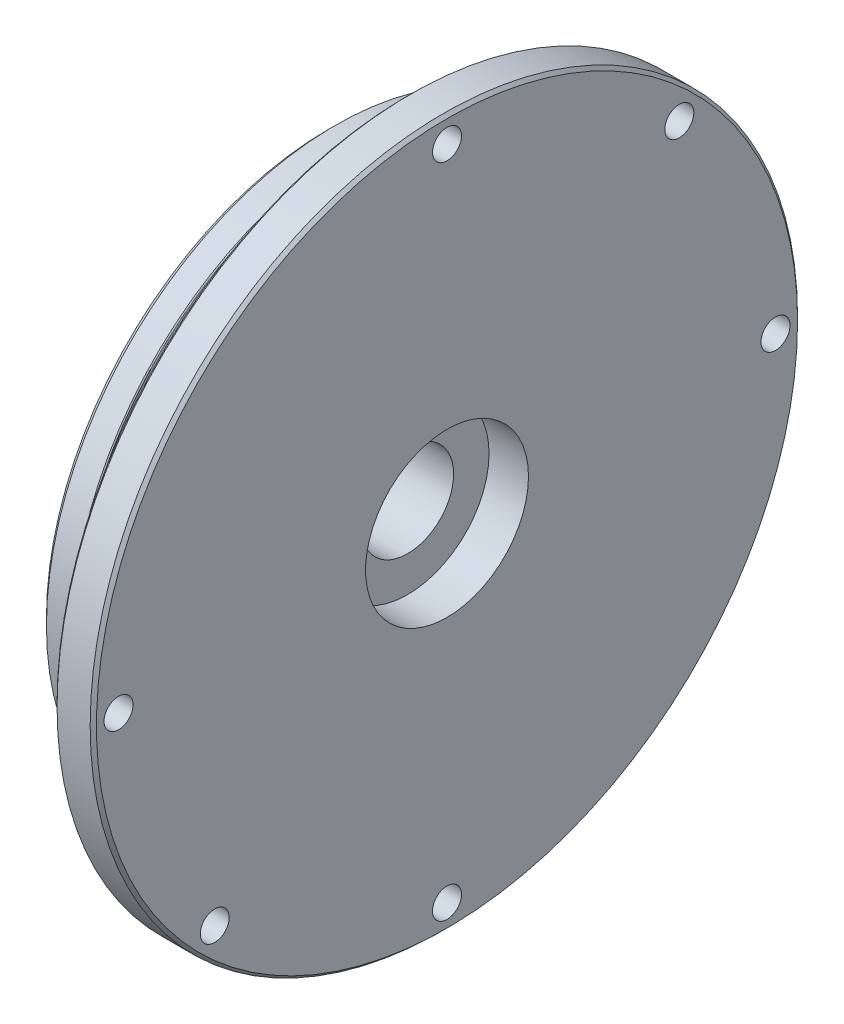
ISO-10303-21;
HEADER;
FILE_DESCRIPTION(('STEP AP214'),'2;1');
FILE_NAME('part.step','',(''),(''),'','','');
FILE_SCHEMA(('AUTOMOTIVE_DESIGN { 1 0 10303 214 1 1 1 1 }'));
ENDSEC;
DATA;
#1=APPLICATION_CONTEXT('core data for automotive mechanical design processes');
#2=APPLICATION_PROTOCOL_DEFINITION('international standard','automotive_design',2000,#1);
#3=PRODUCT_CONTEXT('',#1,'mechanical');
#4=PRODUCT('Part','Part','',(#3));
#5=PRODUCT_RELATED_PRODUCT_CATEGORY('part','',(#4));
#6=PRODUCT_DEFINITION_FORMATION('','',#4);
#7=PRODUCT_DEFINITION_CONTEXT('part definition',#1,'design');
#8=PRODUCT_DEFINITION('design','',#6,#7);
#9=PRODUCT_DEFINITION_SHAPE('','',#8);
#10=(LENGTH_UNIT() NAMED_UNIT(*) SI_UNIT(.MILLI.,.METRE.));
#11=(NAMED_UNIT(*) PLANE_ANGLE_UNIT() SI_UNIT($,.RADIAN.));
#12=(NAMED_UNIT(*) SI_UNIT($,.STERADIAN.) SOLID_ANGLE_UNIT());
#13=UNCERTAINTY_MEASURE_WITH_UNIT(LENGTH_MEASURE(1.E-05),#10,'distance_accuracy_value','');
#14=(GEOMETRIC_REPRESENTATION_CONTEXT(3) GLOBAL_UNCERTAINTY_ASSIGNED_CONTEXT((#13)) GLOBAL_UNIT_ASSIGNED_CONTEXT((#10,
#11,#12)) REPRESENTATION_CONTEXT('',''));
#15=CARTESIAN_POINT('',(0.,0.,0.));
#16=DIRECTION('',(0.,0.,1.));
#17=DIRECTION('',(1.,0.,0.));
#18=AXIS2_PLACEMENT_3D('',#15,#16,#17);
#19=CARTESIAN_POINT('',(14.2875,0.,0.));
#20=DIRECTION('',(-1.,0.,0.));
#21=DIRECTION('',(0.,0.,1.));
#22=AXIS2_PLACEMENT_3D('',#19,#20,#21);
#23=CYLINDRICAL_SURFACE('',#22,42.7355);
#24=CARTESIAN_POINT('',(13.9065,0.,0.));
#25=DIRECTION('',(1.,0.,0.));
#26=DIRECTION('',(0.,0.,-1.));
#27=AXIS2_PLACEMENT_3D('',#24,#25,#26);
#28=CIRCLE('',#27,42.7355);
#29=CARTESIAN_POINT('',(13.9065,0.,-42.7355));
#30=VERTEX_POINT('',#29);
#31=EDGE_CURVE('E90',#30,#30,#28,.F.);
#32=ORIENTED_EDGE('',*,*,#31,.T.);
#33=EDGE_LOOP('',(#32));
#34=FACE_BOUND('',#33,.T.);
#35=CARTESIAN_POINT('',(9.90599999999998,0.,0.));
#36=DIRECTION('',(-1.,0.,0.));
#37=DIRECTION('',(0.,0.,1.));
#38=AXIS2_PLACEMENT_3D('',#35,#36,#37);
#39=CIRCLE('',#38,42.7355);
#40=CARTESIAN_POINT('',(9.90599999999998,0.,42.7355));
#41=VERTEX_POINT('',#40);
#42=EDGE_CURVE('E94',#41,#41,#39,.F.);
#43=ORIENTED_EDGE('',*,*,#42,.T.);
#44=EDGE_LOOP('',(#43));
#45=FACE_BOUND('',#44,.T.);
#46=ADVANCED_FACE('F34',(#34,#45),#23,.T.);
#47=CARTESIAN_POINT('',(14.2875,42.7355,0.));
#48=DIRECTION('',(1.,0.,0.));
#49=DIRECTION('',(0.,0.,-1.));
#50=AXIS2_PLACEMENT_3D('',#47,#48,#49);
#51=PLANE('',#50);
#52=CARTESIAN_POINT('',(14.2875,0.,0.));
#53=DIRECTION('',(1.,0.,0.));
#54=DIRECTION('',(0.,0.,-1.));
#55=AXIS2_PLACEMENT_3D('',#52,#53,#54);
#56=CIRCLE('',#55,42.3545);
#57=CARTESIAN_POINT('',(14.2875,0.,-42.3545));
#58=VERTEX_POINT('',#57);
#59=EDGE_CURVE('E86',#58,#58,#56,.T.);
#60=ORIENTED_EDGE('',*,*,#59,.T.);
#61=EDGE_LOOP('',(#60));
#62=FACE_BOUND('',#61,.T.);
#63=CARTESIAN_POINT('',(14.2875,0.,0.));
#64=DIRECTION('',(1.,0.,0.));
#65=DIRECTION('',(0.,0.,-1.));
#66=AXIS2_PLACEMENT_3D('',#63,#64,#65);
#67=CIRCLE('',#66,9.8425);
#68=CARTESIAN_POINT('',(14.2875,0.,-9.8425));
#69=VERTEX_POINT('',#68);
#70=EDGE_CURVE('E158',#69,#69,#67,.T.);
#71=ORIENTED_EDGE('',*,*,#70,.F.);
#72=EDGE_LOOP('',(#71));
#73=FACE_BOUND('',#72,.T.);
#74=CARTESIAN_POINT('',(14.2875,-28.0633003783411,28.0633003783412));
#75=DIRECTION('',(-1.,0.,0.));
#76=DIRECTION('',(0.,0.,1.));
#77=AXIS2_PLACEMENT_3D('',#74,#75,#76);
#78=CIRCLE('',#77,1.75259999999999);
#79=CARTESIAN_POINT('',(14.2875,-28.0633003783411,29.8159003783411));
#80=VERTEX_POINT('',#79);
#81=EDGE_CURVE('E140',#80,#80,#78,.T.);
#82=ORIENTED_EDGE('',*,*,#81,.T.);
#83=EDGE_LOOP('',(#82));
#84=FACE_BOUND('',#83,.T.);
#85=CARTESIAN_POINT('',(14.2875,28.0633003783411,-28.0633003783411));
#86=DIRECTION('',(-1.,0.,0.));
#87=DIRECTION('',(0.,0.,1.));
#88=AXIS2_PLACEMENT_3D('',#85,#86,#87);
#89=CIRCLE('',#88,1.75259999999999);
#90=CARTESIAN_POINT('',(14.2875,28.0633003783411,-26.3107003783412));
#91=VERTEX_POINT('',#90);
#92=EDGE_CURVE('E134',#91,#91,#89,.T.);
#93=ORIENTED_EDGE('',*,*,#92,.T.);
#94=EDGE_LOOP('',(#93));
#95=FACE_BOUND('',#94,.T.);
#96=CARTESIAN_POINT('',(14.2875,0.,39.6875));
#97=DIRECTION('',(-1.,0.,0.));
#98=DIRECTION('',(0.,0.,1.));
#99=AXIS2_PLACEMENT_3D('',#96,#97,#98);
#100=CIRCLE('',#99,1.75259999999999);
#101=CARTESIAN_POINT('',(14.2875,0.,41.4401));
#102=VERTEX_POINT('',#101);
#103=EDGE_CURVE('E126',#102,#102,#100,.T.);
#104=ORIENTED_EDGE('',*,*,#103,.T.);
#105=EDGE_LOOP('',(#104));
#106=FACE_BOUND('',#105,.T.);
#107=CARTESIAN_POINT('',(14.2875,0.,-39.6875));
#108=DIRECTION('',(-1.,0.,0.));
#109=DIRECTION('',(0.,0.,1.));
#110=AXIS2_PLACEMENT_3D('',#107,#108,#109);
#111=CIRCLE('',#110,1.75259999999999);
#112=CARTESIAN_POINT('',(14.2875,0.,-37.9349));
#113=VERTEX_POINT('',#112);
#114=EDGE_CURVE('E118',#113,#113,#111,.T.);
#115=ORIENTED_EDGE('',*,*,#114,.T.);
#116=EDGE_LOOP('',(#115));
#117=FACE_BOUND('',#116,.T.);
#118=CARTESIAN_POINT('',(14.2875,-39.6875,0.));
#119=DIRECTION('',(-1.,0.,0.));
#120=DIRECTION('',(0.,0.,1.));
#121=AXIS2_PLACEMENT_3D('',#118,#119,#120);
#122=CIRCLE('',#121,1.75259999999999);
#123=CARTESIAN_POINT('',(14.2875,-39.6875,1.75259999999999));
#124=VERTEX_POINT('',#123);
#125=EDGE_CURVE('E110',#124,#124,#122,.T.);
#126=ORIENTED_EDGE('',*,*,#125,.T.);
#127=EDGE_LOOP('',(#126));
#128=FACE_BOUND('',#127,.T.);
#129=CARTESIAN_POINT('',(14.2875,39.6875,0.));
#130=DIRECTION('',(-1.,0.,0.));
#131=DIRECTION('',(0.,0.,1.));
#132=AXIS2_PLACEMENT_3D('',#129,#130,#131);
#133=CIRCLE('',#132,1.75259999999999);
#134=CARTESIAN_POINT('',(14.2875,39.6875,1.75259999999999));
#135=VERTEX_POINT('',#134);
#136=EDGE_CURVE('E102',#135,#135,#133,.T.);
#137=ORIENTED_EDGE('',*,*,#136,.T.);
#138=EDGE_LOOP('',(#137));
#139=FACE_BOUND('',#138,.T.);
#140=ADVANCED_FACE('F164',(#62,#73,#84,#95,#106,#117,#128,#139),#51,.T.);
#141=CARTESIAN_POINT('',(0.,0.,0.));
#142=DIRECTION('',(-1.,0.,0.));
#143=DIRECTION('',(0.,0.,1.));
#144=AXIS2_PLACEMENT_3D('',#141,#142,#143);
#145=PLANE('',#144);
#146=CARTESIAN_POINT('',(0.,0.,0.));
#147=DIRECTION('',(-1.,0.,0.));
#148=DIRECTION('',(0.,0.,1.));
#149=AXIS2_PLACEMENT_3D('',#146,#147,#148);
#150=CIRCLE('',#149,34.1122);
#151=CARTESIAN_POINT('',(0.,0.,34.1122));
#152=VERTEX_POINT('',#151);
#153=EDGE_CURVE('E78',#152,#152,#150,.T.);
#154=ORIENTED_EDGE('',*,*,#153,.T.);
#155=EDGE_LOOP('',(#154));
#156=FACE_BOUND('',#155,.T.);
#157=CARTESIAN_POINT('',(0.,0.,0.));
#158=DIRECTION('',(1.,0.,0.));
#159=DIRECTION('',(0.,0.,-1.));
#160=AXIS2_PLACEMENT_3D('',#157,#158,#159);
#161=CIRCLE('',#160,5.55625);
#162=CARTESIAN_POINT('',(0.,0.,-5.55625));
#163=VERTEX_POINT('',#162);
#164=EDGE_CURVE('E148',#163,#163,#161,.T.);
#165=ORIENTED_EDGE('',*,*,#164,.T.);
#166=EDGE_LOOP('',(#165));
#167=FACE_BOUND('',#166,.T.);
#168=ADVANCED_FACE('F167',(#156,#167),#145,.T.);
#169=CARTESIAN_POINT('',(14.2875,0.,0.));
#170=DIRECTION('',(-1.,0.,0.));
#171=DIRECTION('',(0.,0.,1.));
#172=AXIS2_PLACEMENT_3D('',#169,#170,#171);
#173=CYLINDRICAL_SURFACE('',#172,34.8996);
#174=CARTESIAN_POINT('',(3.81,0.,0.));
#175=DIRECTION('',(1.,0.,0.));
#176=DIRECTION('',(0.,0.,-1.));
#177=AXIS2_PLACEMENT_3D('',#174,#175,#176);
#178=CIRCLE('',#177,34.8996);
#179=CARTESIAN_POINT('',(3.81,0.,-34.8996));
#180=VERTEX_POINT('',#179);
#181=EDGE_CURVE('E65',#180,#180,#178,.F.);
#182=ORIENTED_EDGE('',*,*,#181,.T.);
#183=EDGE_LOOP('',(#182));
#184=FACE_BOUND('',#183,.T.);
#185=CARTESIAN_POINT('',(0.78740000000003,0.,0.));
#186=DIRECTION('',(-1.,0.,0.));
#187=DIRECTION('',(0.,0.,1.));
#188=AXIS2_PLACEMENT_3D('',#185,#186,#187);
#189=CIRCLE('',#188,34.8996);
#190=CARTESIAN_POINT('',(0.78740000000003,0.,34.8996));
#191=VERTEX_POINT('',#190);
#192=EDGE_CURVE('E75',#191,#191,#189,.F.);
#193=ORIENTED_EDGE('',*,*,#192,.T.);
#194=EDGE_LOOP('',(#193));
#195=FACE_BOUND('',#194,.T.);
#196=ADVANCED_FACE('F252',(#184,#195),#173,.T.);
#197=CARTESIAN_POINT('',(3.937,34.8996,0.));
#198=DIRECTION('',(1.,0.,0.));
#199=DIRECTION('',(0.,0.,-1.));
#200=AXIS2_PLACEMENT_3D('',#197,#198,#199);
#201=PLANE('',#200);
#202=CARTESIAN_POINT('',(3.937,0.,0.));
#203=DIRECTION('',(1.,0.,0.));
#204=DIRECTION('',(0.,0.,-1.));
#205=AXIS2_PLACEMENT_3D('',#202,#203,#204);
#206=CIRCLE('',#205,34.036);
#207=CARTESIAN_POINT('',(3.937,0.,-34.036));
#208=VERTEX_POINT('',#207);
#209=EDGE_CURVE('E10',#208,#208,#206,.F.);
#210=ORIENTED_EDGE('',*,*,#209,.T.);
#211=EDGE_LOOP('',(#210));
#212=FACE_BOUND('',#211,.T.);
#213=CARTESIAN_POINT('',(3.937,0.,0.));
#214=DIRECTION('',(1.,0.,0.));
#215=DIRECTION('',(0.,0.,-1.));
#216=AXIS2_PLACEMENT_3D('',#213,#214,#215);
#217=CIRCLE('',#216,34.7726);
#218=CARTESIAN_POINT('',(3.937,0.,-34.7726));
#219=VERTEX_POINT('',#218);
#220=EDGE_CURVE('E61',#219,#219,#217,.T.);
#221=ORIENTED_EDGE('',*,*,#220,.T.);
#222=EDGE_LOOP('',(#221));
#223=FACE_BOUND('',#222,.T.);
#224=ADVANCED_FACE('F245',(#212,#223),#201,.T.);
#225=CARTESIAN_POINT('',(14.2875,0.,0.));
#226=DIRECTION('',(-1.,0.,0.));
#227=DIRECTION('',(0.,0.,1.));
#228=AXIS2_PLACEMENT_3D('',#225,#226,#227);
#229=CYLINDRICAL_SURFACE('',#228,33.655);
#230=CARTESIAN_POINT('',(5.96899999999999,0.,0.));
#231=DIRECTION('',(-1.,0.,0.));
#232=DIRECTION('',(0.,0.,1.));
#233=AXIS2_PLACEMENT_3D('',#230,#231,#232);
#234=CIRCLE('',#233,33.655);
#235=CARTESIAN_POINT('',(5.96899999999999,0.,33.655));
#236=VERTEX_POINT('',#235);
#237=EDGE_CURVE('E49',#236,#236,#234,.T.);
#238=ORIENTED_EDGE('',*,*,#237,.T.);
#239=EDGE_LOOP('',(#238));
#240=FACE_BOUND('',#239,.T.);
#241=CARTESIAN_POINT('',(4.318,0.,0.));
#242=DIRECTION('',(1.,0.,0.));
#243=DIRECTION('',(0.,0.,-1.));
#244=AXIS2_PLACEMENT_3D('',#241,#242,#243);
#245=CIRCLE('',#244,33.655);
#246=CARTESIAN_POINT('',(4.318,0.,-33.655));
#247=VERTEX_POINT('',#246);
#248=EDGE_CURVE('E55',#247,#247,#245,.T.);
#249=ORIENTED_EDGE('',*,*,#248,.T.);
#250=EDGE_LOOP('',(#249));
#251=FACE_BOUND('',#250,.T.);
#252=ADVANCED_FACE('F204',(#240,#251),#229,.T.);
#253=CARTESIAN_POINT('',(6.35,33.655,0.));
#254=DIRECTION('',(-1.,0.,0.));
#255=DIRECTION('',(0.,0.,1.));
#256=AXIS2_PLACEMENT_3D('',#253,#254,#255);
#257=PLANE('',#256);
#258=CARTESIAN_POINT('',(6.35,0.,0.));
#259=DIRECTION('',(-1.,0.,0.));
#260=DIRECTION('',(0.,0.,1.));
#261=AXIS2_PLACEMENT_3D('',#258,#259,#260);
#262=CIRCLE('',#261,34.036);
#263=CARTESIAN_POINT('',(6.35,0.,34.036));
#264=VERTEX_POINT('',#263);
#265=EDGE_CURVE('E42',#264,#264,#262,.F.);
#266=ORIENTED_EDGE('',*,*,#265,.T.);
#267=EDGE_LOOP('',(#266));
#268=FACE_BOUND('',#267,.T.);
#269=CARTESIAN_POINT('',(6.35,0.,0.));
#270=DIRECTION('',(-1.,0.,0.));
#271=DIRECTION('',(0.,0.,1.));
#272=AXIS2_PLACEMENT_3D('',#269,#270,#271);
#273=CIRCLE('',#272,34.7726);
#274=CARTESIAN_POINT('',(6.35,0.,34.7726));
#275=VERTEX_POINT('',#274);
#276=EDGE_CURVE('E72',#275,#275,#273,.T.);
#277=ORIENTED_EDGE('',*,*,#276,.T.);
#278=EDGE_LOOP('',(#277));
#279=FACE_BOUND('',#278,.T.);
#280=ADVANCED_FACE('F198',(#268,#279),#257,.T.);
#281=CARTESIAN_POINT('',(14.2875,0.,0.));
#282=DIRECTION('',(-1.,0.,0.));
#283=DIRECTION('',(0.,0.,1.));
#284=AXIS2_PLACEMENT_3D('',#281,#282,#283);
#285=CYLINDRICAL_SURFACE('',#284,34.8996);
#286=CARTESIAN_POINT('',(6.47699999999999,0.,0.));
#287=DIRECTION('',(-1.,0.,0.));
#288=DIRECTION('',(0.,0.,1.));
#289=AXIS2_PLACEMENT_3D('',#286,#287,#288);
#290=CIRCLE('',#289,34.8996);
#291=CARTESIAN_POINT('',(6.47699999999999,0.,34.8996));
#292=VERTEX_POINT('',#291);
#293=EDGE_CURVE('E68',#292,#292,#290,.F.);
#294=ORIENTED_EDGE('',*,*,#293,.T.);
#295=EDGE_LOOP('',(#294));
#296=FACE_BOUND('',#295,.T.);
#297=CARTESIAN_POINT('',(9.525,0.,0.));
#298=DIRECTION('',(-1.,0.,0.));
#299=DIRECTION('',(0.,0.,1.));
#300=AXIS2_PLACEMENT_3D('',#297,#298,#299);
#301=CIRCLE('',#300,34.8996);
#302=CARTESIAN_POINT('',(9.525,0.,34.8996));
#303=VERTEX_POINT('',#302);
#304=EDGE_CURVE('E98',#303,#303,#301,.T.);
#305=ORIENTED_EDGE('',*,*,#304,.T.);
#306=EDGE_LOOP('',(#305));
#307=FACE_BOUND('',#306,.T.);
#308=ADVANCED_FACE('F192',(#296,#307),#285,.T.);
#309=CARTESIAN_POINT('',(9.525,34.8996,0.));
#310=DIRECTION('',(-1.,0.,0.));
#311=DIRECTION('',(0.,0.,1.));
#312=AXIS2_PLACEMENT_3D('',#309,#310,#311);
#313=PLANE('',#312);
#314=CARTESIAN_POINT('',(9.525,0.,0.));
#315=DIRECTION('',(-1.,0.,0.));
#316=DIRECTION('',(0.,0.,1.));
#317=AXIS2_PLACEMENT_3D('',#314,#315,#316);
#318=CIRCLE('',#317,42.3545);
#319=CARTESIAN_POINT('',(9.525,0.,42.3545));
#320=VERTEX_POINT('',#319);
#321=EDGE_CURVE('E82',#320,#320,#318,.T.);
#322=ORIENTED_EDGE('',*,*,#321,.T.);
#323=EDGE_LOOP('',(#322));
#324=FACE_BOUND('',#323,.T.);
#325=CARTESIAN_POINT('',(9.52499999999999,-28.0633003783411,28.0633003783412));
#326=DIRECTION('',(-1.,0.,0.));
#327=DIRECTION('',(0.,0.,1.));
#328=AXIS2_PLACEMENT_3D('',#325,#326,#327);
#329=CIRCLE('',#328,1.75259999999999);
#330=CARTESIAN_POINT('',(9.52499999999999,-28.0633003783411,29.8159003783411));
#331=VERTEX_POINT('',#330);
#332=EDGE_CURVE('E144',#331,#331,#329,.T.);
#333=ORIENTED_EDGE('',*,*,#332,.F.);
#334=EDGE_LOOP('',(#333));
#335=FACE_BOUND('',#334,.T.);
#336=CARTESIAN_POINT('',(9.52499999999999,28.0633003783411,-28.0633003783411));
#337=DIRECTION('',(-1.,0.,0.));
#338=DIRECTION('',(0.,0.,1.));
#339=AXIS2_PLACEMENT_3D('',#336,#337,#338);
#340=CIRCLE('',#339,1.75259999999999);
#341=CARTESIAN_POINT('',(9.52499999999999,28.0633003783411,-26.3107003783412));
#342=VERTEX_POINT('',#341);
#343=EDGE_CURVE('E137',#342,#342,#340,.T.);
#344=ORIENTED_EDGE('',*,*,#343,.F.);
#345=EDGE_LOOP('',(#344));
#346=FACE_BOUND('',#345,.T.);
#347=CARTESIAN_POINT('',(9.52499999999999,0.,39.6875));
#348=DIRECTION('',(-1.,0.,0.));
#349=DIRECTION('',(0.,0.,1.));
#350=AXIS2_PLACEMENT_3D('',#347,#348,#349);
#351=CIRCLE('',#350,1.75259999999999);
#352=CARTESIAN_POINT('',(9.52499999999999,0.,41.4401));
#353=VERTEX_POINT('',#352);
#354=EDGE_CURVE('E130',#353,#353,#351,.T.);
#355=ORIENTED_EDGE('',*,*,#354,.F.);
#356=EDGE_LOOP('',(#355));
#357=FACE_BOUND('',#356,.T.);
#358=CARTESIAN_POINT('',(9.52499999999999,0.,-39.6875));
#359=DIRECTION('',(-1.,0.,0.));
#360=DIRECTION('',(0.,0.,1.));
#361=AXIS2_PLACEMENT_3D('',#358,#359,#360);
#362=CIRCLE('',#361,1.75259999999999);
#363=CARTESIAN_POINT('',(9.52499999999999,0.,-37.9349));
#364=VERTEX_POINT('',#363);
#365=EDGE_CURVE('E122',#364,#364,#362,.T.);
#366=ORIENTED_EDGE('',*,*,#365,.F.);
#367=EDGE_LOOP('',(#366));
#368=FACE_BOUND('',#367,.T.);
#369=CARTESIAN_POINT('',(9.52499999999999,-39.6875,0.));
#370=DIRECTION('',(-1.,0.,0.));
#371=DIRECTION('',(0.,0.,1.));
#372=AXIS2_PLACEMENT_3D('',#369,#370,#371);
#373=CIRCLE('',#372,1.75259999999999);
#374=CARTESIAN_POINT('',(9.52499999999999,-39.6875,1.75259999999999));
#375=VERTEX_POINT('',#374);
#376=EDGE_CURVE('E114',#375,#375,#373,.T.);
#377=ORIENTED_EDGE('',*,*,#376,.F.);
#378=EDGE_LOOP('',(#377));
#379=FACE_BOUND('',#378,.T.);
#380=CARTESIAN_POINT('',(9.52499999999999,39.6875,0.));
#381=DIRECTION('',(-1.,0.,0.));
#382=DIRECTION('',(0.,0.,1.));
#383=AXIS2_PLACEMENT_3D('',#380,#381,#382);
#384=CIRCLE('',#383,1.75259999999999);
#385=CARTESIAN_POINT('',(9.52499999999999,39.6875,1.75259999999999));
#386=VERTEX_POINT('',#385);
#387=EDGE_CURVE('E106',#386,#386,#384,.T.);
#388=ORIENTED_EDGE('',*,*,#387,.F.);
#389=EDGE_LOOP('',(#388));
#390=FACE_BOUND('',#389,.T.);
#391=ORIENTED_EDGE('',*,*,#304,.F.);
#392=EDGE_LOOP('',(#391));
#393=FACE_BOUND('',#392,.T.);
#394=ADVANCED_FACE('F186',(#324,#335,#346,#357,#368,#379,#390,#393),#313,.T.);
#395=CARTESIAN_POINT('',(9.525,39.6875,0.));
#396=DIRECTION('',(-1.,0.,0.));
#397=DIRECTION('',(0.,0.,1.));
#398=AXIS2_PLACEMENT_3D('',#395,#396,#397);
#399=CYLINDRICAL_SURFACE('',#398,1.75259999999999);
#400=ORIENTED_EDGE('',*,*,#136,.F.);
#401=EDGE_LOOP('',(#400));
#402=FACE_BOUND('',#401,.T.);
#403=ORIENTED_EDGE('',*,*,#387,.T.);
#404=EDGE_LOOP('',(#403));
#405=FACE_BOUND('',#404,.T.);
#406=ADVANCED_FACE('F182',(#402,#405),#399,.F.);
#407=CARTESIAN_POINT('',(9.525,-39.6875,0.));
#408=DIRECTION('',(-1.,0.,0.));
#409=DIRECTION('',(0.,0.,1.));
#410=AXIS2_PLACEMENT_3D('',#407,#408,#409);
#411=CYLINDRICAL_SURFACE('',#410,1.75259999999999);
#412=ORIENTED_EDGE('',*,*,#125,.F.);
#413=EDGE_LOOP('',(#412));
#414=FACE_BOUND('',#413,.T.);
#415=ORIENTED_EDGE('',*,*,#376,.T.);
#416=EDGE_LOOP('',(#415));
#417=FACE_BOUND('',#416,.T.);
#418=ADVANCED_FACE('F185',(#414,#417),#411,.F.);
#419=CARTESIAN_POINT('',(9.525,0.,-39.6875));
#420=DIRECTION('',(-1.,0.,0.));
#421=DIRECTION('',(0.,0.,1.));
#422=AXIS2_PLACEMENT_3D('',#419,#420,#421);
#423=CYLINDRICAL_SURFACE('',#422,1.75259999999999);
#424=ORIENTED_EDGE('',*,*,#114,.F.);
#425=EDGE_LOOP('',(#424));
#426=FACE_BOUND('',#425,.T.);
#427=ORIENTED_EDGE('',*,*,#365,.T.);
#428=EDGE_LOOP('',(#427));
#429=FACE_BOUND('',#428,.T.);
#430=ADVANCED_FACE('F293',(#426,#429),#423,.F.);
#431=CARTESIAN_POINT('',(9.525,0.,39.6875));
#432=DIRECTION('',(-1.,0.,0.));
#433=DIRECTION('',(0.,0.,1.));
#434=AXIS2_PLACEMENT_3D('',#431,#432,#433);
#435=CYLINDRICAL_SURFACE('',#434,1.75259999999999);
#436=ORIENTED_EDGE('',*,*,#103,.F.);
#437=EDGE_LOOP('',(#436));
#438=FACE_BOUND('',#437,.T.);
#439=ORIENTED_EDGE('',*,*,#354,.T.);
#440=EDGE_LOOP('',(#439));
#441=FACE_BOUND('',#440,.T.);
#442=ADVANCED_FACE('F289',(#438,#441),#435,.F.);
#443=CARTESIAN_POINT('',(9.525,28.0633003783411,-28.0633003783411));
#444=DIRECTION('',(-1.,0.,0.));
#445=DIRECTION('',(0.,0.,1.));
#446=AXIS2_PLACEMENT_3D('',#443,#444,#445);
#447=CYLINDRICAL_SURFACE('',#446,1.75259999999999);
#448=ORIENTED_EDGE('',*,*,#92,.F.);
#449=EDGE_LOOP('',(#448));
#450=FACE_BOUND('',#449,.T.);
#451=ORIENTED_EDGE('',*,*,#343,.T.);
#452=EDGE_LOOP('',(#451));
#453=FACE_BOUND('',#452,.T.);
#454=ADVANCED_FACE('F285',(#450,#453),#447,.F.);
#455=CARTESIAN_POINT('',(9.525,-28.0633003783411,28.0633003783412));
#456=DIRECTION('',(-1.,0.,0.));
#457=DIRECTION('',(0.,0.,1.));
#458=AXIS2_PLACEMENT_3D('',#455,#456,#457);
#459=CYLINDRICAL_SURFACE('',#458,1.75259999999999);
#460=ORIENTED_EDGE('',*,*,#81,.F.);
#461=EDGE_LOOP('',(#460));
#462=FACE_BOUND('',#461,.T.);
#463=ORIENTED_EDGE('',*,*,#332,.T.);
#464=EDGE_LOOP('',(#463));
#465=FACE_BOUND('',#464,.T.);
#466=ADVANCED_FACE('F269',(#462,#465),#459,.F.);
#467=CARTESIAN_POINT('',(14.2875,0.,0.));
#468=DIRECTION('',(1.,0.,0.));
#469=DIRECTION('',(0.,0.,-1.));
#470=AXIS2_PLACEMENT_3D('',#467,#468,#469);
#471=CYLINDRICAL_SURFACE('',#470,5.55625000000001);
#472=ORIENTED_EDGE('',*,*,#164,.F.);
#473=EDGE_LOOP('',(#472));
#474=FACE_BOUND('',#473,.T.);
#475=CARTESIAN_POINT('',(9.525,0.,0.));
#476=DIRECTION('',(1.,0.,0.));
#477=DIRECTION('',(0.,0.,-1.));
#478=AXIS2_PLACEMENT_3D('',#475,#476,#477);
#479=CIRCLE('',#478,5.55625000000001);
#480=CARTESIAN_POINT('',(9.525,0.,-5.55625000000001));
#481=VERTEX_POINT('',#480);
#482=EDGE_CURVE('E152',#481,#481,#479,.T.);
#483=ORIENTED_EDGE('',*,*,#482,.T.);
#484=EDGE_LOOP('',(#483));
#485=FACE_BOUND('',#484,.T.);
#486=ADVANCED_FACE('F265',(#474,#485),#471,.F.);
#487=CARTESIAN_POINT('',(9.525,5.55625000000001,0.));
#488=DIRECTION('',(-1.,0.,0.));
#489=DIRECTION('',(0.,0.,1.));
#490=AXIS2_PLACEMENT_3D('',#487,#488,#489);
#491=PLANE('',#490);
#492=ORIENTED_EDGE('',*,*,#482,.F.);
#493=EDGE_LOOP('',(#492));
#494=FACE_BOUND('',#493,.T.);
#495=CARTESIAN_POINT('',(9.525,0.,0.));
#496=DIRECTION('',(1.,0.,0.));
#497=DIRECTION('',(0.,0.,-1.));
#498=AXIS2_PLACEMENT_3D('',#495,#496,#497);
#499=CIRCLE('',#498,9.8425);
#500=CARTESIAN_POINT('',(9.525,0.,-9.8425));
#501=VERTEX_POINT('',#500);
#502=EDGE_CURVE('E155',#501,#501,#499,.T.);
#503=ORIENTED_EDGE('',*,*,#502,.T.);
#504=EDGE_LOOP('',(#503));
#505=FACE_BOUND('',#504,.T.);
#506=ADVANCED_FACE('F268',(#494,#505),#491,.F.);
#507=CARTESIAN_POINT('',(14.2875,0.,0.));
#508=DIRECTION('',(1.,0.,0.));
#509=DIRECTION('',(0.,0.,-1.));
#510=AXIS2_PLACEMENT_3D('',#507,#508,#509);
#511=CYLINDRICAL_SURFACE('',#510,9.8425);
#512=ORIENTED_EDGE('',*,*,#502,.F.);
#513=EDGE_LOOP('',(#512));
#514=FACE_BOUND('',#513,.T.);
#515=ORIENTED_EDGE('',*,*,#70,.T.);
#516=EDGE_LOOP('',(#515));
#517=FACE_BOUND('',#516,.T.);
#518=ADVANCED_FACE('F162',(#514,#517),#511,.F.);
#519=CARTESIAN_POINT('',(13.9065,0.,0.));
#520=DIRECTION('',(-1.,0.,0.));
#521=DIRECTION('',(0.,0.,1.));
#522=AXIS2_PLACEMENT_3D('',#519,#520,#521);
#523=CONICAL_SURFACE('',#522,42.7355,0.785398163397494);
#524=ORIENTED_EDGE('',*,*,#59,.F.);
#525=EDGE_LOOP('',(#524));
#526=FACE_BOUND('',#525,.T.);
#527=ORIENTED_EDGE('',*,*,#31,.F.);
#528=EDGE_LOOP('',(#527));
#529=FACE_BOUND('',#528,.T.);
#530=ADVANCED_FACE('F214',(#526,#529),#523,.T.);
#531=CARTESIAN_POINT('',(9.525,0.,0.));
#532=DIRECTION('',(1.,0.,0.));
#533=DIRECTION('',(0.,0.,-1.));
#534=AXIS2_PLACEMENT_3D('',#531,#532,#533);
#535=CONICAL_SURFACE('',#534,42.3545,0.78539816339743);
#536=ORIENTED_EDGE('',*,*,#42,.F.);
#537=EDGE_LOOP('',(#536));
#538=FACE_BOUND('',#537,.T.);
#539=ORIENTED_EDGE('',*,*,#321,.F.);
#540=EDGE_LOOP('',(#539));
#541=FACE_BOUND('',#540,.T.);
#542=ADVANCED_FACE('F217',(#538,#541),#535,.T.);
#543=CARTESIAN_POINT('',(0.,0.,0.));
#544=DIRECTION('',(1.,0.,0.));
#545=DIRECTION('',(0.,0.,-1.));
#546=AXIS2_PLACEMENT_3D('',#543,#544,#545);
#547=CONICAL_SURFACE('',#546,34.1122,0.785398163397453);
#548=ORIENTED_EDGE('',*,*,#192,.F.);
#549=EDGE_LOOP('',(#548));
#550=FACE_BOUND('',#549,.T.);
#551=ORIENTED_EDGE('',*,*,#153,.F.);
#552=EDGE_LOOP('',(#551));
#553=FACE_BOUND('',#552,.T.);
#554=ADVANCED_FACE('F221',(#550,#553),#547,.T.);
#555=CARTESIAN_POINT('',(6.47699999999999,0.,0.));
#556=DIRECTION('',(-1.,0.,0.));
#557=DIRECTION('',(0.,0.,1.));
#558=AXIS2_PLACEMENT_3D('',#555,#556,#557);
#559=TOROIDAL_SURFACE('',#558,34.7726,0.126999999999999);
#560=ORIENTED_EDGE('',*,*,#293,.F.);
#561=EDGE_LOOP('',(#560));
#562=FACE_BOUND('',#561,.T.);
#563=ORIENTED_EDGE('',*,*,#276,.F.);
#564=EDGE_LOOP('',(#563));
#565=FACE_BOUND('',#564,.T.);
#566=ADVANCED_FACE('F225',(#562,#565),#559,.T.);
#567=CARTESIAN_POINT('',(3.81,0.,0.));
#568=DIRECTION('',(1.,0.,0.));
#569=DIRECTION('',(0.,0.,-1.));
#570=AXIS2_PLACEMENT_3D('',#567,#568,#569);
#571=TOROIDAL_SURFACE('',#570,34.7726,0.126999999999999);
#572=ORIENTED_EDGE('',*,*,#220,.F.);
#573=EDGE_LOOP('',(#572));
#574=FACE_BOUND('',#573,.T.);
#575=ORIENTED_EDGE('',*,*,#181,.F.);
#576=EDGE_LOOP('',(#575));
#577=FACE_BOUND('',#576,.T.);
#578=ADVANCED_FACE('F229',(#574,#577),#571,.T.);
#579=CARTESIAN_POINT('',(5.96899999999999,0.,0.));
#580=DIRECTION('',(-1.,0.,0.));
#581=DIRECTION('',(0.,0.,1.));
#582=AXIS2_PLACEMENT_3D('',#579,#580,#581);
#583=TOROIDAL_SURFACE('',#582,34.036,0.381);
#584=ORIENTED_EDGE('',*,*,#265,.F.);
#585=EDGE_LOOP('',(#584));
#586=FACE_BOUND('',#585,.T.);
#587=ORIENTED_EDGE('',*,*,#237,.F.);
#588=EDGE_LOOP('',(#587));
#589=FACE_BOUND('',#588,.T.);
#590=ADVANCED_FACE('F232',(#586,#589),#583,.F.);
#591=CARTESIAN_POINT('',(4.318,0.,0.));
#592=DIRECTION('',(1.,0.,0.));
#593=DIRECTION('',(0.,0.,-1.));
#594=AXIS2_PLACEMENT_3D('',#591,#592,#593);
#595=TOROIDAL_SURFACE('',#594,34.036,0.381);
#596=ORIENTED_EDGE('',*,*,#248,.F.);
#597=EDGE_LOOP('',(#596));
#598=FACE_BOUND('',#597,.T.);
#599=ORIENTED_EDGE('',*,*,#209,.F.);
#600=EDGE_LOOP('',(#599));
#601=FACE_BOUND('',#600,.T.);
#602=ADVANCED_FACE('F36',(#598,#601),#595,.F.);
#603=CLOSED_SHELL('',(#46,#140,#168,#196,#224,#252,#280,#308,#394,#406,#418,#430,#442,#454,#466,
#486,#506,#518,#530,#542,#554,#566,#578,#590,#602));
#604=MANIFOLD_SOLID_BREP('B2',#603);
#605=ADVANCED_BREP_SHAPE_REPRESENTATION('',(#18,#604),#14);
#606=SHAPE_DEFINITION_REPRESENTATION(#9,#605);
ENDSEC;
END-ISO-10303-21;
